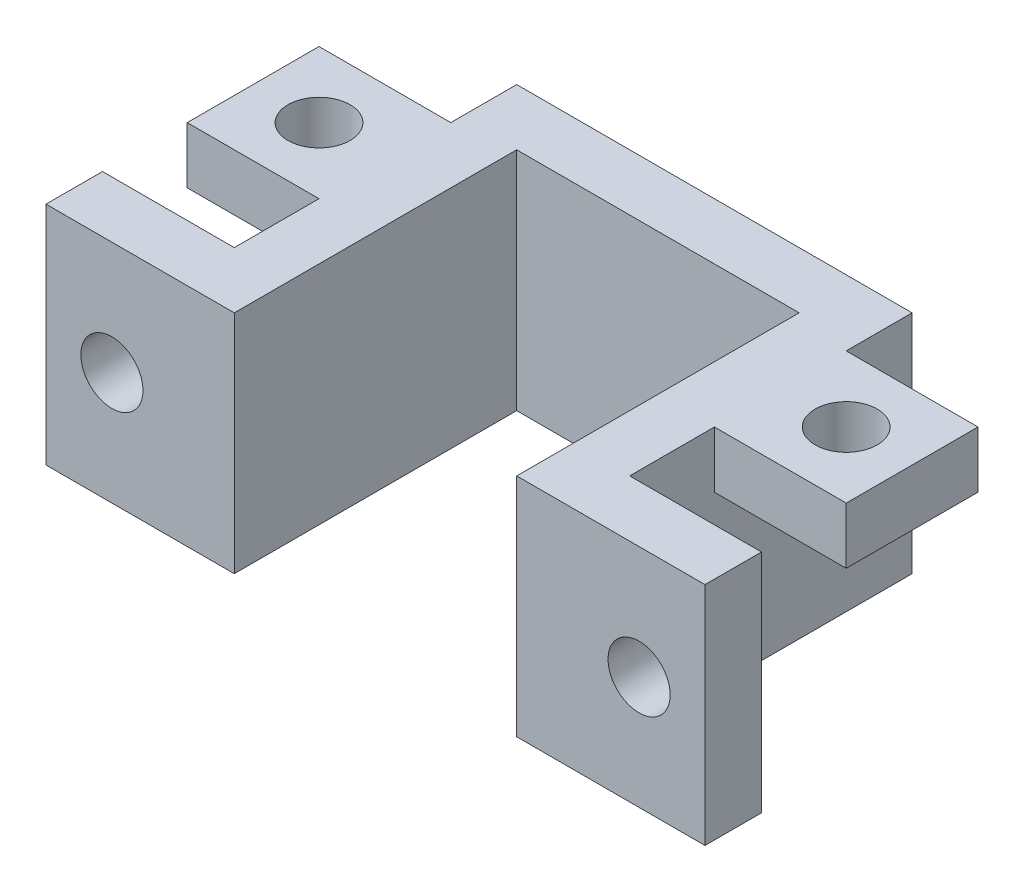
ISO-10303-21;
HEADER;
FILE_DESCRIPTION(('STEP AP214'),'2;1');
FILE_NAME('part.step','',(''),(''),'','','');
FILE_SCHEMA(('AUTOMOTIVE_DESIGN { 1 0 10303 214 1 1 1 1 }'));
ENDSEC;
DATA;
#1=APPLICATION_CONTEXT('core data for automotive mechanical design processes');
#2=APPLICATION_PROTOCOL_DEFINITION('international standard','automotive_design',2000,#1);
#3=PRODUCT_CONTEXT('',#1,'mechanical');
#4=PRODUCT('Part','Part','',(#3));
#5=PRODUCT_RELATED_PRODUCT_CATEGORY('part','',(#4));
#6=PRODUCT_DEFINITION_FORMATION('','',#4);
#7=PRODUCT_DEFINITION_CONTEXT('part definition',#1,'design');
#8=PRODUCT_DEFINITION('design','',#6,#7);
#9=PRODUCT_DEFINITION_SHAPE('','',#8);
#10=(LENGTH_UNIT() NAMED_UNIT(*) SI_UNIT(.MILLI.,.METRE.));
#11=(NAMED_UNIT(*) PLANE_ANGLE_UNIT() SI_UNIT($,.RADIAN.));
#12=(NAMED_UNIT(*) SI_UNIT($,.STERADIAN.) SOLID_ANGLE_UNIT());
#13=UNCERTAINTY_MEASURE_WITH_UNIT(LENGTH_MEASURE(1.E-05),#10,'distance_accuracy_value','');
#14=(GEOMETRIC_REPRESENTATION_CONTEXT(3) GLOBAL_UNCERTAINTY_ASSIGNED_CONTEXT((#13)) GLOBAL_UNIT_ASSIGNED_CONTEXT((#10,
#11,#12)) REPRESENTATION_CONTEXT('',''));
#15=CARTESIAN_POINT('',(0.,0.,0.));
#16=DIRECTION('',(0.,0.,1.));
#17=DIRECTION('',(1.,0.,0.));
#18=AXIS2_PLACEMENT_3D('',#15,#16,#17);
#19=CARTESIAN_POINT('',(-7.5,12.,-7.5));
#20=DIRECTION('',(0.,0.,-1.));
#21=DIRECTION('',(-1.,0.,0.));
#22=AXIS2_PLACEMENT_3D('',#19,#20,#21);
#23=PLANE('',#22);
#24=DIRECTION('',(1.,0.,0.));
#25=VECTOR('',#24,1.);
#26=CARTESIAN_POINT('',(-7.5,0.,-7.5));
#27=LINE('',#26,#25);
#28=CARTESIAN_POINT('',(-7.5,0.,-7.5));
#29=VERTEX_POINT('',#28);
#30=CARTESIAN_POINT('',(7.5,0.,-7.5));
#31=VERTEX_POINT('',#30);
#32=EDGE_CURVE('E291',#29,#31,#27,.T.);
#33=ORIENTED_EDGE('',*,*,#32,.T.);
#34=DIRECTION('',(0.,-1.,0.));
#35=VECTOR('',#34,1.);
#36=CARTESIAN_POINT('',(7.5,12.,-7.5));
#37=LINE('',#36,#35);
#38=CARTESIAN_POINT('',(7.5,12.,-7.5));
#39=VERTEX_POINT('',#38);
#40=EDGE_CURVE('E11',#39,#31,#37,.T.);
#41=ORIENTED_EDGE('',*,*,#40,.F.);
#42=DIRECTION('',(1.,0.,0.));
#43=VECTOR('',#42,1.);
#44=CARTESIAN_POINT('',(-7.5,12.,-7.5));
#45=LINE('',#44,#43);
#46=CARTESIAN_POINT('',(-7.5,12.,-7.5));
#47=VERTEX_POINT('',#46);
#48=EDGE_CURVE('E261',#47,#39,#45,.T.);
#49=ORIENTED_EDGE('',*,*,#48,.F.);
#50=DIRECTION('',(0.,-1.,0.));
#51=VECTOR('',#50,1.);
#52=CARTESIAN_POINT('',(-7.5,12.,-7.5));
#53=LINE('',#52,#51);
#54=EDGE_CURVE('E290',#47,#29,#53,.T.);
#55=ORIENTED_EDGE('',*,*,#54,.T.);
#56=EDGE_LOOP('',(#33,#41,#49,#55));
#57=FACE_BOUND('',#56,.T.);
#58=ADVANCED_FACE('F39',(#57),#23,.F.);
#59=CARTESIAN_POINT('',(7.5,12.,7.5));
#60=DIRECTION('',(1.,0.,0.));
#61=DIRECTION('',(0.,0.,-1.));
#62=AXIS2_PLACEMENT_3D('',#59,#60,#61);
#63=PLANE('',#62);
#64=DIRECTION('',(0.,0.,1.));
#65=VECTOR('',#64,1.);
#66=CARTESIAN_POINT('',(7.5,0.,7.5));
#67=LINE('',#66,#65);
#68=CARTESIAN_POINT('',(7.5,0.,7.5));
#69=VERTEX_POINT('',#68);
#70=EDGE_CURVE('E294',#31,#69,#67,.T.);
#71=ORIENTED_EDGE('',*,*,#70,.T.);
#72=DIRECTION('',(0.,-1.,0.));
#73=VECTOR('',#72,1.);
#74=CARTESIAN_POINT('',(7.5,12.,7.5));
#75=LINE('',#74,#73);
#76=CARTESIAN_POINT('',(7.5,12.,7.5));
#77=VERTEX_POINT('',#76);
#78=EDGE_CURVE('E47',#77,#69,#75,.T.);
#79=ORIENTED_EDGE('',*,*,#78,.F.);
#80=DIRECTION('',(0.,0.,1.));
#81=VECTOR('',#80,1.);
#82=CARTESIAN_POINT('',(7.5,12.,7.5));
#83=LINE('',#82,#81);
#84=EDGE_CURVE('E264',#39,#77,#83,.T.);
#85=ORIENTED_EDGE('',*,*,#84,.F.);
#86=ORIENTED_EDGE('',*,*,#40,.T.);
#87=EDGE_LOOP('',(#71,#79,#85,#86));
#88=FACE_BOUND('',#87,.T.);
#89=ADVANCED_FACE('F370',(#88),#63,.F.);
#90=CARTESIAN_POINT('',(7.5,12.,7.5));
#91=DIRECTION('',(0.,0.,-1.));
#92=DIRECTION('',(-1.,0.,0.));
#93=AXIS2_PLACEMENT_3D('',#90,#91,#92);
#94=PLANE('',#93);
#95=CARTESIAN_POINT('',(14.,6.,7.5));
#96=DIRECTION('',(0.,0.,1.));
#97=DIRECTION('',(1.,0.,0.));
#98=AXIS2_PLACEMENT_3D('',#95,#96,#97);
#99=CIRCLE('',#98,1.65);
#100=CARTESIAN_POINT('',(15.65,6.,7.5));
#101=VERTEX_POINT('',#100);
#102=EDGE_CURVE('E246',#101,#101,#99,.T.);
#103=ORIENTED_EDGE('',*,*,#102,.F.);
#104=EDGE_LOOP('',(#103));
#105=FACE_BOUND('',#104,.T.);
#106=DIRECTION('',(1.,0.,0.));
#107=VECTOR('',#106,1.);
#108=CARTESIAN_POINT('',(7.5,0.,7.5));
#109=LINE('',#108,#107);
#110=CARTESIAN_POINT('',(17.5,0.,7.5));
#111=VERTEX_POINT('',#110);
#112=EDGE_CURVE('E296',#69,#111,#109,.T.);
#113=ORIENTED_EDGE('',*,*,#112,.T.);
#114=DIRECTION('',(0.,-1.,0.));
#115=VECTOR('',#114,1.);
#116=CARTESIAN_POINT('',(17.5,12.,7.5));
#117=LINE('',#116,#115);
#118=CARTESIAN_POINT('',(17.5,12.,7.5));
#119=VERTEX_POINT('',#118);
#120=EDGE_CURVE('E341',#119,#111,#117,.T.);
#121=ORIENTED_EDGE('',*,*,#120,.F.);
#122=DIRECTION('',(1.,0.,0.));
#123=VECTOR('',#122,1.);
#124=CARTESIAN_POINT('',(7.5,12.,7.5));
#125=LINE('',#124,#123);
#126=EDGE_CURVE('E267',#77,#119,#125,.T.);
#127=ORIENTED_EDGE('',*,*,#126,.F.);
#128=ORIENTED_EDGE('',*,*,#78,.T.);
#129=EDGE_LOOP('',(#113,#121,#127,#128));
#130=FACE_BOUND('',#129,.T.);
#131=ADVANCED_FACE('F349',(#105,#130),#94,.F.);
#132=CARTESIAN_POINT('',(17.5,12.,7.5));
#133=DIRECTION('',(-1.,0.,0.));
#134=DIRECTION('',(0.,0.,1.));
#135=AXIS2_PLACEMENT_3D('',#132,#133,#134);
#136=PLANE('',#135);
#137=DIRECTION('',(0.,0.,-1.));
#138=VECTOR('',#137,1.);
#139=CARTESIAN_POINT('',(17.5,0.,7.5));
#140=LINE('',#139,#138);
#141=CARTESIAN_POINT('',(17.5,0.,4.5));
#142=VERTEX_POINT('',#141);
#143=EDGE_CURVE('E298',#111,#142,#140,.T.);
#144=ORIENTED_EDGE('',*,*,#143,.T.);
#145=DIRECTION('',(0.,-1.,0.));
#146=VECTOR('',#145,1.);
#147=CARTESIAN_POINT('',(17.5,12.,4.5));
#148=LINE('',#147,#146);
#149=CARTESIAN_POINT('',(17.5,12.,4.5));
#150=VERTEX_POINT('',#149);
#151=EDGE_CURVE('E338',#150,#142,#148,.T.);
#152=ORIENTED_EDGE('',*,*,#151,.F.);
#153=DIRECTION('',(0.,0.,-1.));
#154=VECTOR('',#153,1.);
#155=CARTESIAN_POINT('',(17.5,12.,7.5));
#156=LINE('',#155,#154);
#157=EDGE_CURVE('E269',#119,#150,#156,.T.);
#158=ORIENTED_EDGE('',*,*,#157,.F.);
#159=ORIENTED_EDGE('',*,*,#120,.T.);
#160=EDGE_LOOP('',(#144,#152,#158,#159));
#161=FACE_BOUND('',#160,.T.);
#162=ADVANCED_FACE('F360',(#161),#136,.F.);
#163=CARTESIAN_POINT('',(17.5,12.,4.5));
#164=DIRECTION('',(0.,0.,1.));
#165=DIRECTION('',(1.,0.,0.));
#166=AXIS2_PLACEMENT_3D('',#163,#164,#165);
#167=PLANE('',#166);
#168=CARTESIAN_POINT('',(14.,6.,4.5));
#169=DIRECTION('',(0.,0.,1.));
#170=DIRECTION('',(1.,0.,0.));
#171=AXIS2_PLACEMENT_3D('',#168,#169,#170);
#172=CIRCLE('',#171,1.65);
#173=CARTESIAN_POINT('',(15.65,6.,4.5));
#174=VERTEX_POINT('',#173);
#175=EDGE_CURVE('E42',#174,#174,#172,.T.);
#176=ORIENTED_EDGE('',*,*,#175,.T.);
#177=EDGE_LOOP('',(#176));
#178=FACE_BOUND('',#177,.T.);
#179=DIRECTION('',(-1.,0.,0.));
#180=VECTOR('',#179,1.);
#181=CARTESIAN_POINT('',(17.5,0.,4.5));
#182=LINE('',#181,#180);
#183=CARTESIAN_POINT('',(10.5,0.,4.5));
#184=VERTEX_POINT('',#183);
#185=EDGE_CURVE('E300',#142,#184,#182,.T.);
#186=ORIENTED_EDGE('',*,*,#185,.T.);
#187=DIRECTION('',(0.,-1.,0.));
#188=VECTOR('',#187,1.);
#189=CARTESIAN_POINT('',(10.5,12.,4.5));
#190=LINE('',#189,#188);
#191=CARTESIAN_POINT('',(10.5,12.,4.5));
#192=VERTEX_POINT('',#191);
#193=EDGE_CURVE('E335',#192,#184,#190,.T.);
#194=ORIENTED_EDGE('',*,*,#193,.F.);
#195=DIRECTION('',(-1.,0.,0.));
#196=VECTOR('',#195,1.);
#197=CARTESIAN_POINT('',(17.5,12.,4.5));
#198=LINE('',#197,#196);
#199=EDGE_CURVE('E271',#150,#192,#198,.T.);
#200=ORIENTED_EDGE('',*,*,#199,.F.);
#201=ORIENTED_EDGE('',*,*,#151,.T.);
#202=EDGE_LOOP('',(#186,#194,#200,#201));
#203=FACE_BOUND('',#202,.T.);
#204=ADVANCED_FACE('F364',(#178,#203),#167,.F.);
#205=CARTESIAN_POINT('',(10.5,12.,4.5));
#206=DIRECTION('',(-1.,0.,0.));
#207=DIRECTION('',(0.,0.,1.));
#208=AXIS2_PLACEMENT_3D('',#205,#206,#207);
#209=PLANE('',#208);
#210=DIRECTION('',(0.,0.,-1.));
#211=VECTOR('',#210,1.);
#212=CARTESIAN_POINT('',(10.5,12.,4.5));
#213=LINE('',#212,#211);
#214=CARTESIAN_POINT('',(10.5,12.,-7.));
#215=VERTEX_POINT('',#214);
#216=CARTESIAN_POINT('',(10.5,12.,-10.5));
#217=VERTEX_POINT('',#216);
#218=EDGE_CURVE('E273',#215,#217,#213,.T.);
#219=ORIENTED_EDGE('',*,*,#218,.F.);
#220=DIRECTION('',(0.,1.,0.));
#221=VECTOR('',#220,1.);
#222=CARTESIAN_POINT('',(10.5,9.,-7.));
#223=LINE('',#222,#221);
#224=CARTESIAN_POINT('',(10.5,9.,-7.));
#225=VERTEX_POINT('',#224);
#226=EDGE_CURVE('E202',#225,#215,#223,.T.);
#227=ORIENTED_EDGE('',*,*,#226,.F.);
#228=DIRECTION('',(0.,0.,1.));
#229=VECTOR('',#228,1.);
#230=CARTESIAN_POINT('',(10.5,9.,0.));
#231=LINE('',#230,#229);
#232=CARTESIAN_POINT('',(10.5,9.,0.));
#233=VERTEX_POINT('',#232);
#234=EDGE_CURVE('E194',#225,#233,#231,.T.);
#235=ORIENTED_EDGE('',*,*,#234,.T.);
#236=DIRECTION('',(0.,1.,0.));
#237=VECTOR('',#236,1.);
#238=CARTESIAN_POINT('',(10.5,9.,0.));
#239=LINE('',#238,#237);
#240=CARTESIAN_POINT('',(10.5,12.,0.));
#241=VERTEX_POINT('',#240);
#242=EDGE_CURVE('E177',#233,#241,#239,.T.);
#243=ORIENTED_EDGE('',*,*,#242,.T.);
#244=EDGE_CURVE('E274',#192,#241,#213,.T.);
#245=ORIENTED_EDGE('',*,*,#244,.F.);
#246=ORIENTED_EDGE('',*,*,#193,.T.);
#247=DIRECTION('',(0.,0.,-1.));
#248=VECTOR('',#247,1.);
#249=CARTESIAN_POINT('',(10.5,0.,4.5));
#250=LINE('',#249,#248);
#251=CARTESIAN_POINT('',(10.5,0.,-10.5));
#252=VERTEX_POINT('',#251);
#253=EDGE_CURVE('E302',#184,#252,#250,.T.);
#254=ORIENTED_EDGE('',*,*,#253,.T.);
#255=DIRECTION('',(0.,-1.,0.));
#256=VECTOR('',#255,1.);
#257=CARTESIAN_POINT('',(10.5,12.,-10.5));
#258=LINE('',#257,#256);
#259=EDGE_CURVE('E332',#217,#252,#258,.T.);
#260=ORIENTED_EDGE('',*,*,#259,.F.);
#261=EDGE_LOOP('',(#219,#227,#235,#243,#245,#246,#254,#260));
#262=FACE_BOUND('',#261,.T.);
#263=ADVANCED_FACE('F201',(#262),#209,.F.);
#264=CARTESIAN_POINT('',(-10.5,12.,-10.5));
#265=DIRECTION('',(0.,0.,1.));
#266=DIRECTION('',(1.,0.,0.));
#267=AXIS2_PLACEMENT_3D('',#264,#265,#266);
#268=PLANE('',#267);
#269=DIRECTION('',(-1.,0.,0.));
#270=VECTOR('',#269,1.);
#271=CARTESIAN_POINT('',(-10.5,0.,-10.5));
#272=LINE('',#271,#270);
#273=CARTESIAN_POINT('',(-10.5,0.,-10.5));
#274=VERTEX_POINT('',#273);
#275=EDGE_CURVE('E304',#252,#274,#272,.T.);
#276=ORIENTED_EDGE('',*,*,#275,.T.);
#277=DIRECTION('',(0.,-1.,0.));
#278=VECTOR('',#277,1.);
#279=CARTESIAN_POINT('',(-10.5,12.,-10.5));
#280=LINE('',#279,#278);
#281=CARTESIAN_POINT('',(-10.5,12.,-10.5));
#282=VERTEX_POINT('',#281);
#283=EDGE_CURVE('E329',#282,#274,#280,.T.);
#284=ORIENTED_EDGE('',*,*,#283,.F.);
#285=DIRECTION('',(-1.,0.,0.));
#286=VECTOR('',#285,1.);
#287=CARTESIAN_POINT('',(-10.5,12.,-10.5));
#288=LINE('',#287,#286);
#289=EDGE_CURVE('E276',#217,#282,#288,.T.);
#290=ORIENTED_EDGE('',*,*,#289,.F.);
#291=ORIENTED_EDGE('',*,*,#259,.T.);
#292=EDGE_LOOP('',(#276,#284,#290,#291));
#293=FACE_BOUND('',#292,.T.);
#294=ADVANCED_FACE('F403',(#293),#268,.F.);
#295=CARTESIAN_POINT('',(-10.5,12.,4.5));
#296=DIRECTION('',(1.,0.,0.));
#297=DIRECTION('',(0.,0.,-1.));
#298=AXIS2_PLACEMENT_3D('',#295,#296,#297);
#299=PLANE('',#298);
#300=DIRECTION('',(0.,0.,1.));
#301=VECTOR('',#300,1.);
#302=CARTESIAN_POINT('',(-10.5,12.,4.5));
#303=LINE('',#302,#301);
#304=CARTESIAN_POINT('',(-10.5,12.,0.));
#305=VERTEX_POINT('',#304);
#306=CARTESIAN_POINT('',(-10.5,12.,4.5));
#307=VERTEX_POINT('',#306);
#308=EDGE_CURVE('E278',#305,#307,#303,.T.);
#309=ORIENTED_EDGE('',*,*,#308,.F.);
#310=DIRECTION('',(0.,1.,0.));
#311=VECTOR('',#310,1.);
#312=CARTESIAN_POINT('',(-10.5,9.,0.));
#313=LINE('',#312,#311);
#314=CARTESIAN_POINT('',(-10.5,9.,0.));
#315=VERTEX_POINT('',#314);
#316=EDGE_CURVE('E244',#315,#305,#313,.T.);
#317=ORIENTED_EDGE('',*,*,#316,.F.);
#318=DIRECTION('',(0.,0.,-1.));
#319=VECTOR('',#318,1.);
#320=CARTESIAN_POINT('',(-10.5,9.,0.));
#321=LINE('',#320,#319);
#322=CARTESIAN_POINT('',(-10.5,9.,-7.));
#323=VERTEX_POINT('',#322);
#324=EDGE_CURVE('E226',#315,#323,#321,.T.);
#325=ORIENTED_EDGE('',*,*,#324,.T.);
#326=DIRECTION('',(0.,1.,0.));
#327=VECTOR('',#326,1.);
#328=CARTESIAN_POINT('',(-10.5,9.,-7.));
#329=LINE('',#328,#327);
#330=CARTESIAN_POINT('',(-10.5,12.,-7.));
#331=VERTEX_POINT('',#330);
#332=EDGE_CURVE('E238',#323,#331,#329,.T.);
#333=ORIENTED_EDGE('',*,*,#332,.T.);
#334=EDGE_CURVE('E279',#282,#331,#303,.T.);
#335=ORIENTED_EDGE('',*,*,#334,.F.);
#336=ORIENTED_EDGE('',*,*,#283,.T.);
#337=DIRECTION('',(0.,0.,1.));
#338=VECTOR('',#337,1.);
#339=CARTESIAN_POINT('',(-10.5,0.,4.5));
#340=LINE('',#339,#338);
#341=CARTESIAN_POINT('',(-10.5,0.,4.5));
#342=VERTEX_POINT('',#341);
#343=EDGE_CURVE('E306',#274,#342,#340,.T.);
#344=ORIENTED_EDGE('',*,*,#343,.T.);
#345=DIRECTION('',(0.,-1.,0.));
#346=VECTOR('',#345,1.);
#347=CARTESIAN_POINT('',(-10.5,12.,4.5));
#348=LINE('',#347,#346);
#349=EDGE_CURVE('E326',#307,#342,#348,.T.);
#350=ORIENTED_EDGE('',*,*,#349,.F.);
#351=EDGE_LOOP('',(#309,#317,#325,#333,#335,#336,#344,#350));
#352=FACE_BOUND('',#351,.T.);
#353=ADVANCED_FACE('F397',(#352),#299,.F.);
#354=CARTESIAN_POINT('',(-17.5,12.,4.5));
#355=DIRECTION('',(0.,0.,1.));
#356=DIRECTION('',(1.,0.,0.));
#357=AXIS2_PLACEMENT_3D('',#354,#355,#356);
#358=PLANE('',#357);
#359=CARTESIAN_POINT('',(-14.,6.,4.5));
#360=DIRECTION('',(0.,0.,1.));
#361=DIRECTION('',(1.,0.,0.));
#362=AXIS2_PLACEMENT_3D('',#359,#360,#361);
#363=CIRCLE('',#362,1.65);
#364=CARTESIAN_POINT('',(-12.35,6.,4.5));
#365=VERTEX_POINT('',#364);
#366=EDGE_CURVE('E256',#365,#365,#363,.T.);
#367=ORIENTED_EDGE('',*,*,#366,.T.);
#368=EDGE_LOOP('',(#367));
#369=FACE_BOUND('',#368,.T.);
#370=DIRECTION('',(-1.,0.,0.));
#371=VECTOR('',#370,1.);
#372=CARTESIAN_POINT('',(-17.5,0.,4.5));
#373=LINE('',#372,#371);
#374=CARTESIAN_POINT('',(-17.5,0.,4.5));
#375=VERTEX_POINT('',#374);
#376=EDGE_CURVE('E308',#342,#375,#373,.T.);
#377=ORIENTED_EDGE('',*,*,#376,.T.);
#378=DIRECTION('',(0.,-1.,0.));
#379=VECTOR('',#378,1.);
#380=CARTESIAN_POINT('',(-17.5,12.,4.5));
#381=LINE('',#380,#379);
#382=CARTESIAN_POINT('',(-17.5,12.,4.5));
#383=VERTEX_POINT('',#382);
#384=EDGE_CURVE('E323',#383,#375,#381,.T.);
#385=ORIENTED_EDGE('',*,*,#384,.F.);
#386=DIRECTION('',(-1.,0.,0.));
#387=VECTOR('',#386,1.);
#388=CARTESIAN_POINT('',(-17.5,12.,4.5));
#389=LINE('',#388,#387);
#390=EDGE_CURVE('E282',#307,#383,#389,.T.);
#391=ORIENTED_EDGE('',*,*,#390,.F.);
#392=ORIENTED_EDGE('',*,*,#349,.T.);
#393=EDGE_LOOP('',(#377,#385,#391,#392));
#394=FACE_BOUND('',#393,.T.);
#395=ADVANCED_FACE('F392',(#369,#394),#358,.F.);
#396=CARTESIAN_POINT('',(-17.5,12.,7.5));
#397=DIRECTION('',(1.,0.,0.));
#398=DIRECTION('',(0.,0.,-1.));
#399=AXIS2_PLACEMENT_3D('',#396,#397,#398);
#400=PLANE('',#399);
#401=DIRECTION('',(0.,0.,1.));
#402=VECTOR('',#401,1.);
#403=CARTESIAN_POINT('',(-17.5,0.,7.5));
#404=LINE('',#403,#402);
#405=CARTESIAN_POINT('',(-17.5,0.,7.5));
#406=VERTEX_POINT('',#405);
#407=EDGE_CURVE('E310',#375,#406,#404,.T.);
#408=ORIENTED_EDGE('',*,*,#407,.T.);
#409=DIRECTION('',(0.,-1.,0.));
#410=VECTOR('',#409,1.);
#411=CARTESIAN_POINT('',(-17.5,12.,7.5));
#412=LINE('',#411,#410);
#413=CARTESIAN_POINT('',(-17.5,12.,7.5));
#414=VERTEX_POINT('',#413);
#415=EDGE_CURVE('E320',#414,#406,#412,.T.);
#416=ORIENTED_EDGE('',*,*,#415,.F.);
#417=DIRECTION('',(0.,0.,1.));
#418=VECTOR('',#417,1.);
#419=CARTESIAN_POINT('',(-17.5,12.,7.5));
#420=LINE('',#419,#418);
#421=EDGE_CURVE('E284',#383,#414,#420,.T.);
#422=ORIENTED_EDGE('',*,*,#421,.F.);
#423=ORIENTED_EDGE('',*,*,#384,.T.);
#424=EDGE_LOOP('',(#408,#416,#422,#423));
#425=FACE_BOUND('',#424,.T.);
#426=ADVANCED_FACE('F386',(#425),#400,.F.);
#427=CARTESIAN_POINT('',(-7.5,12.,7.5));
#428=DIRECTION('',(0.,0.,-1.));
#429=DIRECTION('',(-1.,0.,0.));
#430=AXIS2_PLACEMENT_3D('',#427,#428,#429);
#431=PLANE('',#430);
#432=CARTESIAN_POINT('',(-14.,6.,7.5));
#433=DIRECTION('',(0.,0.,1.));
#434=DIRECTION('',(1.,0.,0.));
#435=AXIS2_PLACEMENT_3D('',#432,#433,#434);
#436=CIRCLE('',#435,1.65);
#437=CARTESIAN_POINT('',(-12.35,6.,7.5));
#438=VERTEX_POINT('',#437);
#439=EDGE_CURVE('E253',#438,#438,#436,.T.);
#440=ORIENTED_EDGE('',*,*,#439,.F.);
#441=EDGE_LOOP('',(#440));
#442=FACE_BOUND('',#441,.T.);
#443=DIRECTION('',(1.,0.,0.));
#444=VECTOR('',#443,1.);
#445=CARTESIAN_POINT('',(-7.5,0.,7.5));
#446=LINE('',#445,#444);
#447=CARTESIAN_POINT('',(-7.5,0.,7.5));
#448=VERTEX_POINT('',#447);
#449=EDGE_CURVE('E312',#406,#448,#446,.T.);
#450=ORIENTED_EDGE('',*,*,#449,.T.);
#451=DIRECTION('',(0.,-1.,0.));
#452=VECTOR('',#451,1.);
#453=CARTESIAN_POINT('',(-7.5,12.,7.5));
#454=LINE('',#453,#452);
#455=CARTESIAN_POINT('',(-7.5,12.,7.5));
#456=VERTEX_POINT('',#455);
#457=EDGE_CURVE('E317',#456,#448,#454,.T.);
#458=ORIENTED_EDGE('',*,*,#457,.F.);
#459=DIRECTION('',(1.,0.,0.));
#460=VECTOR('',#459,1.);
#461=CARTESIAN_POINT('',(-7.5,12.,7.5));
#462=LINE('',#461,#460);
#463=EDGE_CURVE('E286',#414,#456,#462,.T.);
#464=ORIENTED_EDGE('',*,*,#463,.F.);
#465=ORIENTED_EDGE('',*,*,#415,.T.);
#466=EDGE_LOOP('',(#450,#458,#464,#465));
#467=FACE_BOUND('',#466,.T.);
#468=ADVANCED_FACE('F382',(#442,#467),#431,.F.);
#469=CARTESIAN_POINT('',(-7.5,12.,7.5));
#470=DIRECTION('',(-1.,0.,0.));
#471=DIRECTION('',(0.,0.,1.));
#472=AXIS2_PLACEMENT_3D('',#469,#470,#471);
#473=PLANE('',#472);
#474=DIRECTION('',(0.,0.,-1.));
#475=VECTOR('',#474,1.);
#476=CARTESIAN_POINT('',(-7.5,0.,7.5));
#477=LINE('',#476,#475);
#478=EDGE_CURVE('E265',#448,#29,#477,.T.);
#479=ORIENTED_EDGE('',*,*,#478,.T.);
#480=ORIENTED_EDGE('',*,*,#54,.F.);
#481=DIRECTION('',(0.,0.,-1.));
#482=VECTOR('',#481,1.);
#483=CARTESIAN_POINT('',(-7.5,12.,7.5));
#484=LINE('',#483,#482);
#485=EDGE_CURVE('E288',#456,#47,#484,.T.);
#486=ORIENTED_EDGE('',*,*,#485,.F.);
#487=ORIENTED_EDGE('',*,*,#457,.T.);
#488=EDGE_LOOP('',(#479,#480,#486,#487));
#489=FACE_BOUND('',#488,.T.);
#490=ADVANCED_FACE('F377',(#489),#473,.F.);
#491=CARTESIAN_POINT('',(0.,12.,0.));
#492=DIRECTION('',(0.,1.,0.));
#493=DIRECTION('',(0.,0.,1.));
#494=AXIS2_PLACEMENT_3D('',#491,#492,#493);
#495=PLANE('',#494);
#496=ORIENTED_EDGE('',*,*,#48,.T.);
#497=ORIENTED_EDGE('',*,*,#84,.T.);
#498=ORIENTED_EDGE('',*,*,#126,.T.);
#499=ORIENTED_EDGE('',*,*,#157,.T.);
#500=ORIENTED_EDGE('',*,*,#199,.T.);
#501=ORIENTED_EDGE('',*,*,#244,.T.);
#502=DIRECTION('',(1.,0.,0.));
#503=VECTOR('',#502,1.);
#504=CARTESIAN_POINT('',(10.5,12.,0.));
#505=LINE('',#504,#503);
#506=CARTESIAN_POINT('',(17.5,12.,0.));
#507=VERTEX_POINT('',#506);
#508=EDGE_CURVE('E182',#241,#507,#505,.T.);
#509=ORIENTED_EDGE('',*,*,#508,.T.);
#510=DIRECTION('',(0.,0.,-1.));
#511=VECTOR('',#510,1.);
#512=CARTESIAN_POINT('',(17.5,12.,0.));
#513=LINE('',#512,#511);
#514=CARTESIAN_POINT('',(17.5,12.,-7.));
#515=VERTEX_POINT('',#514);
#516=EDGE_CURVE('E204',#507,#515,#513,.T.);
#517=ORIENTED_EDGE('',*,*,#516,.T.);
#518=DIRECTION('',(-1.,0.,0.));
#519=VECTOR('',#518,1.);
#520=CARTESIAN_POINT('',(10.5,12.,-7.));
#521=LINE('',#520,#519);
#522=EDGE_CURVE('E54',#515,#215,#521,.T.);
#523=ORIENTED_EDGE('',*,*,#522,.T.);
#524=ORIENTED_EDGE('',*,*,#218,.T.);
#525=ORIENTED_EDGE('',*,*,#289,.T.);
#526=ORIENTED_EDGE('',*,*,#334,.T.);
#527=DIRECTION('',(-1.,0.,0.));
#528=VECTOR('',#527,1.);
#529=CARTESIAN_POINT('',(-10.5,12.,-7.));
#530=LINE('',#529,#528);
#531=CARTESIAN_POINT('',(-17.5,12.,-7.));
#532=VERTEX_POINT('',#531);
#533=EDGE_CURVE('E223',#331,#532,#530,.T.);
#534=ORIENTED_EDGE('',*,*,#533,.T.);
#535=DIRECTION('',(0.,0.,1.));
#536=VECTOR('',#535,1.);
#537=CARTESIAN_POINT('',(-17.5,12.,0.));
#538=LINE('',#537,#536);
#539=CARTESIAN_POINT('',(-17.5,12.,0.));
#540=VERTEX_POINT('',#539);
#541=EDGE_CURVE('E241',#532,#540,#538,.T.);
#542=ORIENTED_EDGE('',*,*,#541,.T.);
#543=DIRECTION('',(1.,0.,0.));
#544=VECTOR('',#543,1.);
#545=CARTESIAN_POINT('',(-10.5,12.,0.));
#546=LINE('',#545,#544);
#547=EDGE_CURVE('E61',#540,#305,#546,.T.);
#548=ORIENTED_EDGE('',*,*,#547,.T.);
#549=ORIENTED_EDGE('',*,*,#308,.T.);
#550=ORIENTED_EDGE('',*,*,#390,.T.);
#551=ORIENTED_EDGE('',*,*,#421,.T.);
#552=ORIENTED_EDGE('',*,*,#463,.T.);
#553=ORIENTED_EDGE('',*,*,#485,.T.);
#554=EDGE_LOOP('',(#496,#497,#498,#499,#500,#501,#509,#517,#523,#524,#525,#526,#534,#542,#548,
#549,#550,#551,#552,#553));
#555=FACE_BOUND('',#554,.T.);
#556=CARTESIAN_POINT('',(-14.,12.,-3.5));
#557=DIRECTION('',(0.,1.,0.));
#558=DIRECTION('',(0.,0.,1.));
#559=AXIS2_PLACEMENT_3D('',#556,#557,#558);
#560=CIRCLE('',#559,1.65);
#561=CARTESIAN_POINT('',(-14.,12.,-1.85));
#562=VERTEX_POINT('',#561);
#563=EDGE_CURVE('E216',#562,#562,#560,.T.);
#564=ORIENTED_EDGE('',*,*,#563,.F.);
#565=EDGE_LOOP('',(#564));
#566=FACE_BOUND('',#565,.T.);
#567=CARTESIAN_POINT('',(14.,12.,-3.5));
#568=DIRECTION('',(0.,1.,0.));
#569=DIRECTION('',(0.,0.,1.));
#570=AXIS2_PLACEMENT_3D('',#567,#568,#569);
#571=CIRCLE('',#570,1.65);
#572=CARTESIAN_POINT('',(14.,12.,-1.85));
#573=VERTEX_POINT('',#572);
#574=EDGE_CURVE('E207',#573,#573,#571,.T.);
#575=ORIENTED_EDGE('',*,*,#574,.F.);
#576=EDGE_LOOP('',(#575));
#577=FACE_BOUND('',#576,.T.);
#578=ADVANCED_FACE('F366',(#555,#566,#577),#495,.T.);
#579=CARTESIAN_POINT('',(0.,0.,0.));
#580=DIRECTION('',(0.,1.,0.));
#581=DIRECTION('',(0.,0.,1.));
#582=AXIS2_PLACEMENT_3D('',#579,#580,#581);
#583=PLANE('',#582);
#584=ORIENTED_EDGE('',*,*,#32,.F.);
#585=ORIENTED_EDGE('',*,*,#478,.F.);
#586=ORIENTED_EDGE('',*,*,#449,.F.);
#587=ORIENTED_EDGE('',*,*,#407,.F.);
#588=ORIENTED_EDGE('',*,*,#376,.F.);
#589=ORIENTED_EDGE('',*,*,#343,.F.);
#590=ORIENTED_EDGE('',*,*,#275,.F.);
#591=ORIENTED_EDGE('',*,*,#253,.F.);
#592=ORIENTED_EDGE('',*,*,#185,.F.);
#593=ORIENTED_EDGE('',*,*,#143,.F.);
#594=ORIENTED_EDGE('',*,*,#112,.F.);
#595=ORIENTED_EDGE('',*,*,#70,.F.);
#596=EDGE_LOOP('',(#584,#585,#586,#587,#588,#589,#590,#591,#592,#593,#594,#595));
#597=FACE_BOUND('',#596,.T.);
#598=ADVANCED_FACE('F355',(#597),#583,.F.);
#599=CARTESIAN_POINT('',(-14.,6.,-4.5));
#600=DIRECTION('',(0.,0.,1.));
#601=DIRECTION('',(1.,0.,0.));
#602=AXIS2_PLACEMENT_3D('',#599,#600,#601);
#603=CYLINDRICAL_SURFACE('',#602,1.65);
#604=ORIENTED_EDGE('',*,*,#439,.T.);
#605=EDGE_LOOP('',(#604));
#606=FACE_BOUND('',#605,.T.);
#607=ORIENTED_EDGE('',*,*,#366,.F.);
#608=EDGE_LOOP('',(#607));
#609=FACE_BOUND('',#608,.T.);
#610=ADVANCED_FACE('F459',(#606,#609),#603,.F.);
#611=CARTESIAN_POINT('',(14.,6.,-4.5));
#612=DIRECTION('',(0.,0.,1.));
#613=DIRECTION('',(1.,0.,0.));
#614=AXIS2_PLACEMENT_3D('',#611,#612,#613);
#615=CYLINDRICAL_SURFACE('',#614,1.65);
#616=ORIENTED_EDGE('',*,*,#102,.T.);
#617=EDGE_LOOP('',(#616));
#618=FACE_BOUND('',#617,.T.);
#619=ORIENTED_EDGE('',*,*,#175,.F.);
#620=EDGE_LOOP('',(#619));
#621=FACE_BOUND('',#620,.T.);
#622=ADVANCED_FACE('F424',(#618,#621),#615,.F.);
#623=CARTESIAN_POINT('',(-10.5,9.,0.));
#624=DIRECTION('',(0.,0.,1.));
#625=DIRECTION('',(1.,0.,0.));
#626=AXIS2_PLACEMENT_3D('',#623,#624,#625);
#627=PLANE('',#626);
#628=ORIENTED_EDGE('',*,*,#547,.F.);
#629=DIRECTION('',(0.,1.,0.));
#630=VECTOR('',#629,1.);
#631=CARTESIAN_POINT('',(-17.5,9.,0.));
#632=LINE('',#631,#630);
#633=CARTESIAN_POINT('',(-17.5,9.,0.));
#634=VERTEX_POINT('',#633);
#635=EDGE_CURVE('E247',#634,#540,#632,.T.);
#636=ORIENTED_EDGE('',*,*,#635,.F.);
#637=DIRECTION('',(1.,0.,0.));
#638=VECTOR('',#637,1.);
#639=CARTESIAN_POINT('',(-10.5,9.,0.));
#640=LINE('',#639,#638);
#641=EDGE_CURVE('E235',#634,#315,#640,.T.);
#642=ORIENTED_EDGE('',*,*,#641,.T.);
#643=ORIENTED_EDGE('',*,*,#316,.T.);
#644=EDGE_LOOP('',(#628,#636,#642,#643));
#645=FACE_BOUND('',#644,.T.);
#646=ADVANCED_FACE('F414',(#645),#627,.T.);
#647=CARTESIAN_POINT('',(-17.5,9.,0.));
#648=DIRECTION('',(-1.,0.,0.));
#649=DIRECTION('',(0.,0.,1.));
#650=AXIS2_PLACEMENT_3D('',#647,#648,#649);
#651=PLANE('',#650);
#652=ORIENTED_EDGE('',*,*,#541,.F.);
#653=DIRECTION('',(0.,1.,0.));
#654=VECTOR('',#653,1.);
#655=CARTESIAN_POINT('',(-17.5,9.,-7.));
#656=LINE('',#655,#654);
#657=CARTESIAN_POINT('',(-17.5,9.,-7.));
#658=VERTEX_POINT('',#657);
#659=EDGE_CURVE('E249',#658,#532,#656,.T.);
#660=ORIENTED_EDGE('',*,*,#659,.F.);
#661=DIRECTION('',(0.,0.,1.));
#662=VECTOR('',#661,1.);
#663=CARTESIAN_POINT('',(-17.5,9.,0.));
#664=LINE('',#663,#662);
#665=EDGE_CURVE('E232',#658,#634,#664,.T.);
#666=ORIENTED_EDGE('',*,*,#665,.T.);
#667=ORIENTED_EDGE('',*,*,#635,.T.);
#668=EDGE_LOOP('',(#652,#660,#666,#667));
#669=FACE_BOUND('',#668,.T.);
#670=ADVANCED_FACE('F416',(#669),#651,.T.);
#671=CARTESIAN_POINT('',(-10.5,9.,-7.));
#672=DIRECTION('',(0.,0.,-1.));
#673=DIRECTION('',(-1.,0.,0.));
#674=AXIS2_PLACEMENT_3D('',#671,#672,#673);
#675=PLANE('',#674);
#676=ORIENTED_EDGE('',*,*,#533,.F.);
#677=ORIENTED_EDGE('',*,*,#332,.F.);
#678=DIRECTION('',(-1.,0.,0.));
#679=VECTOR('',#678,1.);
#680=CARTESIAN_POINT('',(-10.5,9.,-7.));
#681=LINE('',#680,#679);
#682=EDGE_CURVE('E229',#323,#658,#681,.T.);
#683=ORIENTED_EDGE('',*,*,#682,.T.);
#684=ORIENTED_EDGE('',*,*,#659,.T.);
#685=EDGE_LOOP('',(#676,#677,#683,#684));
#686=FACE_BOUND('',#685,.T.);
#687=ADVANCED_FACE('F407',(#686),#675,.T.);
#688=CARTESIAN_POINT('',(0.,9.,0.));
#689=DIRECTION('',(0.,1.,0.));
#690=DIRECTION('',(0.,0.,1.));
#691=AXIS2_PLACEMENT_3D('',#688,#689,#690);
#692=PLANE('',#691);
#693=CARTESIAN_POINT('',(-14.,9.,-3.5));
#694=DIRECTION('',(0.,1.,0.));
#695=DIRECTION('',(0.,0.,1.));
#696=AXIS2_PLACEMENT_3D('',#693,#694,#695);
#697=CIRCLE('',#696,1.65);
#698=CARTESIAN_POINT('',(-14.,9.,-1.85));
#699=VERTEX_POINT('',#698);
#700=EDGE_CURVE('E220',#699,#699,#697,.T.);
#701=ORIENTED_EDGE('',*,*,#700,.T.);
#702=EDGE_LOOP('',(#701));
#703=FACE_BOUND('',#702,.T.);
#704=ORIENTED_EDGE('',*,*,#324,.F.);
#705=ORIENTED_EDGE('',*,*,#641,.F.);
#706=ORIENTED_EDGE('',*,*,#665,.F.);
#707=ORIENTED_EDGE('',*,*,#682,.F.);
#708=EDGE_LOOP('',(#704,#705,#706,#707));
#709=FACE_BOUND('',#708,.T.);
#710=ADVANCED_FACE('F411',(#703,#709),#692,.F.);
#711=CARTESIAN_POINT('',(-14.,9.,-3.5));
#712=DIRECTION('',(0.,1.,0.));
#713=DIRECTION('',(0.,0.,1.));
#714=AXIS2_PLACEMENT_3D('',#711,#712,#713);
#715=CYLINDRICAL_SURFACE('',#714,1.65);
#716=ORIENTED_EDGE('',*,*,#700,.F.);
#717=EDGE_LOOP('',(#716));
#718=FACE_BOUND('',#717,.T.);
#719=ORIENTED_EDGE('',*,*,#563,.T.);
#720=EDGE_LOOP('',(#719));
#721=FACE_BOUND('',#720,.T.);
#722=ADVANCED_FACE('F512',(#718,#721),#715,.F.);
#723=CARTESIAN_POINT('',(10.5,9.,-7.));
#724=DIRECTION('',(0.,0.,-1.));
#725=DIRECTION('',(-1.,0.,0.));
#726=AXIS2_PLACEMENT_3D('',#723,#724,#725);
#727=PLANE('',#726);
#728=ORIENTED_EDGE('',*,*,#522,.F.);
#729=DIRECTION('',(0.,1.,0.));
#730=VECTOR('',#729,1.);
#731=CARTESIAN_POINT('',(17.5,9.,-7.));
#732=LINE('',#731,#730);
#733=CARTESIAN_POINT('',(17.5,9.,-7.));
#734=VERTEX_POINT('',#733);
#735=EDGE_CURVE('E217',#734,#515,#732,.T.);
#736=ORIENTED_EDGE('',*,*,#735,.F.);
#737=DIRECTION('',(-1.,0.,0.));
#738=VECTOR('',#737,1.);
#739=CARTESIAN_POINT('',(10.5,9.,-7.));
#740=LINE('',#739,#738);
#741=EDGE_CURVE('E188',#734,#225,#740,.T.);
#742=ORIENTED_EDGE('',*,*,#741,.T.);
#743=ORIENTED_EDGE('',*,*,#226,.T.);
#744=EDGE_LOOP('',(#728,#736,#742,#743));
#745=FACE_BOUND('',#744,.T.);
#746=ADVANCED_FACE('F520',(#745),#727,.T.);
#747=CARTESIAN_POINT('',(17.5,9.,0.));
#748=DIRECTION('',(1.,0.,0.));
#749=DIRECTION('',(0.,0.,-1.));
#750=AXIS2_PLACEMENT_3D('',#747,#748,#749);
#751=PLANE('',#750);
#752=ORIENTED_EDGE('',*,*,#516,.F.);
#753=DIRECTION('',(0.,1.,0.));
#754=VECTOR('',#753,1.);
#755=CARTESIAN_POINT('',(17.5,9.,0.));
#756=LINE('',#755,#754);
#757=CARTESIAN_POINT('',(17.5,9.,0.));
#758=VERTEX_POINT('',#757);
#759=EDGE_CURVE('E187',#758,#507,#756,.T.);
#760=ORIENTED_EDGE('',*,*,#759,.F.);
#761=DIRECTION('',(0.,0.,-1.));
#762=VECTOR('',#761,1.);
#763=CARTESIAN_POINT('',(17.5,9.,0.));
#764=LINE('',#763,#762);
#765=EDGE_CURVE('E197',#758,#734,#764,.T.);
#766=ORIENTED_EDGE('',*,*,#765,.T.);
#767=ORIENTED_EDGE('',*,*,#735,.T.);
#768=EDGE_LOOP('',(#752,#760,#766,#767));
#769=FACE_BOUND('',#768,.T.);
#770=ADVANCED_FACE('F528',(#769),#751,.T.);
#771=CARTESIAN_POINT('',(10.5,9.,0.));
#772=DIRECTION('',(0.,0.,1.));
#773=DIRECTION('',(1.,0.,0.));
#774=AXIS2_PLACEMENT_3D('',#771,#772,#773);
#775=PLANE('',#774);
#776=ORIENTED_EDGE('',*,*,#508,.F.);
#777=ORIENTED_EDGE('',*,*,#242,.F.);
#778=DIRECTION('',(1.,0.,0.));
#779=VECTOR('',#778,1.);
#780=CARTESIAN_POINT('',(10.5,9.,0.));
#781=LINE('',#780,#779);
#782=EDGE_CURVE('E180',#233,#758,#781,.T.);
#783=ORIENTED_EDGE('',*,*,#782,.T.);
#784=ORIENTED_EDGE('',*,*,#759,.T.);
#785=EDGE_LOOP('',(#776,#777,#783,#784));
#786=FACE_BOUND('',#785,.T.);
#787=ADVANCED_FACE('F179',(#786),#775,.T.);
#788=CARTESIAN_POINT('',(0.,9.,0.));
#789=DIRECTION('',(0.,-1.,0.));
#790=DIRECTION('',(0.,0.,-1.));
#791=AXIS2_PLACEMENT_3D('',#788,#789,#790);
#792=PLANE('',#791);
#793=CARTESIAN_POINT('',(14.,9.,-3.5));
#794=DIRECTION('',(0.,1.,0.));
#795=DIRECTION('',(0.,0.,1.));
#796=AXIS2_PLACEMENT_3D('',#793,#794,#795);
#797=CIRCLE('',#796,1.65);
#798=CARTESIAN_POINT('',(14.,9.,-1.85));
#799=VERTEX_POINT('',#798);
#800=EDGE_CURVE('E213',#799,#799,#797,.T.);
#801=ORIENTED_EDGE('',*,*,#800,.T.);
#802=EDGE_LOOP('',(#801));
#803=FACE_BOUND('',#802,.T.);
#804=ORIENTED_EDGE('',*,*,#234,.F.);
#805=ORIENTED_EDGE('',*,*,#741,.F.);
#806=ORIENTED_EDGE('',*,*,#765,.F.);
#807=ORIENTED_EDGE('',*,*,#782,.F.);
#808=EDGE_LOOP('',(#804,#805,#806,#807));
#809=FACE_BOUND('',#808,.T.);
#810=ADVANCED_FACE('F192',(#803,#809),#792,.T.);
#811=CARTESIAN_POINT('',(14.,9.,-3.5));
#812=DIRECTION('',(0.,1.,0.));
#813=DIRECTION('',(0.,0.,1.));
#814=AXIS2_PLACEMENT_3D('',#811,#812,#813);
#815=CYLINDRICAL_SURFACE('',#814,1.65);
#816=ORIENTED_EDGE('',*,*,#800,.F.);
#817=EDGE_LOOP('',(#816));
#818=FACE_BOUND('',#817,.T.);
#819=ORIENTED_EDGE('',*,*,#574,.T.);
#820=EDGE_LOOP('',(#819));
#821=FACE_BOUND('',#820,.T.);
#822=ADVANCED_FACE('F549',(#818,#821),#815,.F.);
#823=CLOSED_SHELL('',(#58,#89,#131,#162,#204,#263,#294,#353,#395,#426,#468,#490,#578,#598,#610,
#622,#646,#670,#687,#710,#722,#746,#770,#787,#810,#822));
#824=MANIFOLD_SOLID_BREP('B2',#823);
#825=ADVANCED_BREP_SHAPE_REPRESENTATION('',(#18,#824),#14);
#826=SHAPE_DEFINITION_REPRESENTATION(#9,#825);
ENDSEC;
END-ISO-10303-21;
